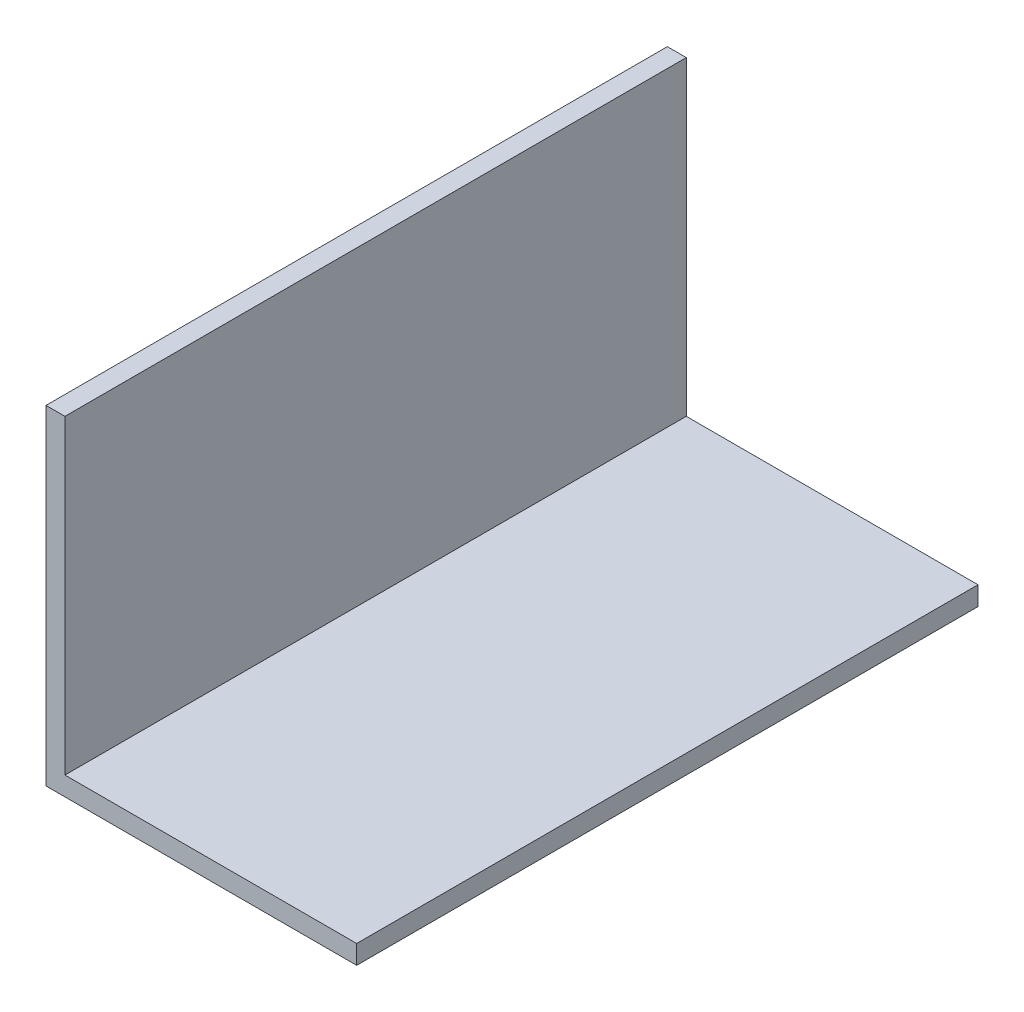
ISO-10303-21;
HEADER;
FILE_DESCRIPTION(('STEP AP214'),'2;1');
FILE_NAME('part.step','',(''),(''),'','','');
FILE_SCHEMA(('AUTOMOTIVE_DESIGN { 1 0 10303 214 1 1 1 1 }'));
ENDSEC;
DATA;
#1=APPLICATION_CONTEXT('core data for automotive mechanical design processes');
#2=APPLICATION_PROTOCOL_DEFINITION('international standard','automotive_design',2000,#1);
#3=PRODUCT_CONTEXT('',#1,'mechanical');
#4=PRODUCT('Part','Part','',(#3));
#5=PRODUCT_RELATED_PRODUCT_CATEGORY('part','',(#4));
#6=PRODUCT_DEFINITION_FORMATION('','',#4);
#7=PRODUCT_DEFINITION_CONTEXT('part definition',#1,'design');
#8=PRODUCT_DEFINITION('design','',#6,#7);
#9=PRODUCT_DEFINITION_SHAPE('','',#8);
#10=(LENGTH_UNIT() NAMED_UNIT(*) SI_UNIT(.MILLI.,.METRE.));
#11=(NAMED_UNIT(*) PLANE_ANGLE_UNIT() SI_UNIT($,.RADIAN.));
#12=(NAMED_UNIT(*) SI_UNIT($,.STERADIAN.) SOLID_ANGLE_UNIT());
#13=UNCERTAINTY_MEASURE_WITH_UNIT(LENGTH_MEASURE(1.E-05),#10,'distance_accuracy_value','');
#14=(GEOMETRIC_REPRESENTATION_CONTEXT(3) GLOBAL_UNCERTAINTY_ASSIGNED_CONTEXT((#13)) GLOBAL_UNIT_ASSIGNED_CONTEXT((#10,
#11,#12)) REPRESENTATION_CONTEXT('',''));
#15=CARTESIAN_POINT('',(0.,0.,0.));
#16=DIRECTION('',(0.,0.,1.));
#17=DIRECTION('',(1.,0.,0.));
#18=AXIS2_PLACEMENT_3D('',#15,#16,#17);
#19=CARTESIAN_POINT('',(4999.99999998,0.,-4999.99));
#20=DIRECTION('',(0.,-1.,0.));
#21=DIRECTION('',(1.,0.,0.));
#22=AXIS2_PLACEMENT_3D('',#19,#20,#21);
#23=PLANE('',#22);
#24=DIRECTION('',(0.,0.,1.));
#25=VECTOR('',#24,1.);
#26=CARTESIAN_POINT('',(4999.99999998,0.,-4999.99));
#27=LINE('',#26,#25);
#28=CARTESIAN_POINT('',(4999.99999998,0.,-4999.99));
#29=VERTEX_POINT('',#28);
#30=CARTESIAN_POINT('',(4999.99999998,0.,4999.99999998));
#31=VERTEX_POINT('',#30);
#32=EDGE_CURVE('E41',#29,#31,#27,.T.);
#33=ORIENTED_EDGE('',*,*,#32,.T.);
#34=DIRECTION('',(1.,0.,0.));
#35=VECTOR('',#34,1.);
#36=CARTESIAN_POINT('',(4999.99999998,0.,4999.99999998));
#37=LINE('',#36,#35);
#38=CARTESIAN_POINT('',(0.,0.,4999.99999998));
#39=VERTEX_POINT('',#38);
#40=EDGE_CURVE('E90',#39,#31,#37,.T.);
#41=ORIENTED_EDGE('',*,*,#40,.F.);
#42=DIRECTION('',(0.,0.,1.));
#43=VECTOR('',#42,1.);
#44=CARTESIAN_POINT('',(0.,0.,-4999.99));
#45=LINE('',#44,#43);
#46=CARTESIAN_POINT('',(0.,0.,-4999.99));
#47=VERTEX_POINT('',#46);
#48=EDGE_CURVE('E11',#47,#39,#45,.T.);
#49=ORIENTED_EDGE('',*,*,#48,.F.);
#50=DIRECTION('',(1.,0.,0.));
#51=VECTOR('',#50,1.);
#52=CARTESIAN_POINT('',(4999.99999998,0.,-4999.99));
#53=LINE('',#52,#51);
#54=EDGE_CURVE('E91',#47,#29,#53,.T.);
#55=ORIENTED_EDGE('',*,*,#54,.T.);
#56=EDGE_LOOP('',(#33,#41,#49,#55));
#57=FACE_BOUND('',#56,.T.);
#58=ADVANCED_FACE('F38',(#57),#23,.T.);
#59=CARTESIAN_POINT('',(0.,0.,-4999.99));
#60=DIRECTION('',(-1.,0.,0.));
#61=DIRECTION('',(0.,0.,1.));
#62=AXIS2_PLACEMENT_3D('',#59,#60,#61);
#63=PLANE('',#62);
#64=ORIENTED_EDGE('',*,*,#48,.T.);
#65=DIRECTION('',(0.,-1.,0.));
#66=VECTOR('',#65,1.);
#67=CARTESIAN_POINT('',(0.,0.,4999.99999998));
#68=LINE('',#67,#66);
#69=CARTESIAN_POINT('',(0.,5304.79999998,4999.99999998));
#70=VERTEX_POINT('',#69);
#71=EDGE_CURVE('E108',#70,#39,#68,.T.);
#72=ORIENTED_EDGE('',*,*,#71,.F.);
#73=DIRECTION('',(0.,0.,1.));
#74=VECTOR('',#73,1.);
#75=CARTESIAN_POINT('',(0.,5304.79999998,-4999.99));
#76=LINE('',#75,#74);
#77=CARTESIAN_POINT('',(0.,5304.79999998,-4999.99));
#78=VERTEX_POINT('',#77);
#79=EDGE_CURVE('E46',#78,#70,#76,.T.);
#80=ORIENTED_EDGE('',*,*,#79,.F.);
#81=DIRECTION('',(0.,-1.,0.));
#82=VECTOR('',#81,1.);
#83=CARTESIAN_POINT('',(0.,0.,-4999.99));
#84=LINE('',#83,#82);
#85=EDGE_CURVE('E96',#78,#47,#84,.T.);
#86=ORIENTED_EDGE('',*,*,#85,.T.);
#87=EDGE_LOOP('',(#64,#72,#80,#86));
#88=FACE_BOUND('',#87,.T.);
#89=ADVANCED_FACE('F148',(#88),#63,.T.);
#90=CARTESIAN_POINT('',(0.,5304.79999998,-4999.99));
#91=DIRECTION('',(0.,1.,0.));
#92=DIRECTION('',(0.,0.,1.));
#93=AXIS2_PLACEMENT_3D('',#90,#91,#92);
#94=PLANE('',#93);
#95=ORIENTED_EDGE('',*,*,#79,.T.);
#96=DIRECTION('',(-1.,0.,0.));
#97=VECTOR('',#96,1.);
#98=CARTESIAN_POINT('',(0.,5304.79999998,4999.99999998));
#99=LINE('',#98,#97);
#100=CARTESIAN_POINT('',(304.8,5304.79999998,4999.99999998));
#101=VERTEX_POINT('',#100);
#102=EDGE_CURVE('E115',#101,#70,#99,.T.);
#103=ORIENTED_EDGE('',*,*,#102,.F.);
#104=DIRECTION('',(0.,0.,1.));
#105=VECTOR('',#104,1.);
#106=CARTESIAN_POINT('',(304.8,5304.79999998,-4999.99));
#107=LINE('',#106,#105);
#108=CARTESIAN_POINT('',(304.8,5304.79999998,-4999.99));
#109=VERTEX_POINT('',#108);
#110=EDGE_CURVE('E131',#109,#101,#107,.T.);
#111=ORIENTED_EDGE('',*,*,#110,.F.);
#112=DIRECTION('',(-1.,0.,0.));
#113=VECTOR('',#112,1.);
#114=CARTESIAN_POINT('',(0.,5304.79999998,-4999.99));
#115=LINE('',#114,#113);
#116=EDGE_CURVE('E127',#109,#78,#115,.T.);
#117=ORIENTED_EDGE('',*,*,#116,.T.);
#118=EDGE_LOOP('',(#95,#103,#111,#117));
#119=FACE_BOUND('',#118,.T.);
#120=ADVANCED_FACE('F144',(#119),#94,.T.);
#121=CARTESIAN_POINT('',(304.8,5304.79999998,-4999.99));
#122=DIRECTION('',(1.,0.,0.));
#123=DIRECTION('',(0.,1.,0.));
#124=AXIS2_PLACEMENT_3D('',#121,#122,#123);
#125=PLANE('',#124);
#126=ORIENTED_EDGE('',*,*,#110,.T.);
#127=DIRECTION('',(0.,1.,0.));
#128=VECTOR('',#127,1.);
#129=CARTESIAN_POINT('',(304.8,5304.79999998,4999.99999998));
#130=LINE('',#129,#128);
#131=CARTESIAN_POINT('',(304.800000000001,304.8,4999.99999998));
#132=VERTEX_POINT('',#131);
#133=EDGE_CURVE('E112',#132,#101,#130,.T.);
#134=ORIENTED_EDGE('',*,*,#133,.F.);
#135=DIRECTION('',(0.,0.,1.));
#136=VECTOR('',#135,1.);
#137=CARTESIAN_POINT('',(304.800000000001,304.8,-4999.99));
#138=LINE('',#137,#136);
#139=CARTESIAN_POINT('',(304.800000000001,304.8,-4999.99));
#140=VERTEX_POINT('',#139);
#141=EDGE_CURVE('E133',#140,#132,#138,.T.);
#142=ORIENTED_EDGE('',*,*,#141,.F.);
#143=DIRECTION('',(0.,1.,0.));
#144=VECTOR('',#143,1.);
#145=CARTESIAN_POINT('',(304.8,5304.79999998,-4999.99));
#146=LINE('',#145,#144);
#147=EDGE_CURVE('E124',#140,#109,#146,.T.);
#148=ORIENTED_EDGE('',*,*,#147,.T.);
#149=EDGE_LOOP('',(#126,#134,#142,#148));
#150=FACE_BOUND('',#149,.T.);
#151=ADVANCED_FACE('F141',(#150),#125,.T.);
#152=CARTESIAN_POINT('',(304.800000000001,304.8,-4999.99));
#153=DIRECTION('',(0.,1.,0.));
#154=DIRECTION('',(-1.,0.,0.));
#155=AXIS2_PLACEMENT_3D('',#152,#153,#154);
#156=PLANE('',#155);
#157=ORIENTED_EDGE('',*,*,#141,.T.);
#158=DIRECTION('',(-1.,0.,0.));
#159=VECTOR('',#158,1.);
#160=CARTESIAN_POINT('',(304.800000000001,304.8,4999.99999998));
#161=LINE('',#160,#159);
#162=CARTESIAN_POINT('',(4999.99999998,304.8,4999.99999998));
#163=VERTEX_POINT('',#162);
#164=EDGE_CURVE('E103',#163,#132,#161,.T.);
#165=ORIENTED_EDGE('',*,*,#164,.F.);
#166=DIRECTION('',(0.,0.,1.));
#167=VECTOR('',#166,1.);
#168=CARTESIAN_POINT('',(4999.99999998,304.8,-4999.99));
#169=LINE('',#168,#167);
#170=CARTESIAN_POINT('',(4999.99999998,304.8,-4999.99));
#171=VERTEX_POINT('',#170);
#172=EDGE_CURVE('E95',#171,#163,#169,.T.);
#173=ORIENTED_EDGE('',*,*,#172,.F.);
#174=DIRECTION('',(-1.,0.,0.));
#175=VECTOR('',#174,1.);
#176=CARTESIAN_POINT('',(304.800000000001,304.8,-4999.99));
#177=LINE('',#176,#175);
#178=EDGE_CURVE('E121',#171,#140,#177,.T.);
#179=ORIENTED_EDGE('',*,*,#178,.T.);
#180=EDGE_LOOP('',(#157,#165,#173,#179));
#181=FACE_BOUND('',#180,.T.);
#182=ADVANCED_FACE('F135',(#181),#156,.T.);
#183=CARTESIAN_POINT('',(4999.99999998,304.8,-4999.99));
#184=DIRECTION('',(1.,0.,0.));
#185=DIRECTION('',(0.,0.,-1.));
#186=AXIS2_PLACEMENT_3D('',#183,#184,#185);
#187=PLANE('',#186);
#188=ORIENTED_EDGE('',*,*,#172,.T.);
#189=DIRECTION('',(0.,1.,0.));
#190=VECTOR('',#189,1.);
#191=CARTESIAN_POINT('',(4999.99999998,304.8,4999.99999998));
#192=LINE('',#191,#190);
#193=EDGE_CURVE('E98',#31,#163,#192,.T.);
#194=ORIENTED_EDGE('',*,*,#193,.F.);
#195=ORIENTED_EDGE('',*,*,#32,.F.);
#196=DIRECTION('',(0.,1.,0.));
#197=VECTOR('',#196,1.);
#198=CARTESIAN_POINT('',(4999.99999998,304.8,-4999.99));
#199=LINE('',#198,#197);
#200=EDGE_CURVE('E119',#29,#171,#199,.T.);
#201=ORIENTED_EDGE('',*,*,#200,.T.);
#202=EDGE_LOOP('',(#188,#194,#195,#201));
#203=FACE_BOUND('',#202,.T.);
#204=ADVANCED_FACE('F99',(#203),#187,.T.);
#205=CARTESIAN_POINT('',(0.,0.,-4999.99));
#206=DIRECTION('',(0.,0.,-1.));
#207=DIRECTION('',(-1.,0.,0.));
#208=AXIS2_PLACEMENT_3D('',#205,#206,#207);
#209=PLANE('',#208);
#210=ORIENTED_EDGE('',*,*,#54,.F.);
#211=ORIENTED_EDGE('',*,*,#85,.F.);
#212=ORIENTED_EDGE('',*,*,#116,.F.);
#213=ORIENTED_EDGE('',*,*,#147,.F.);
#214=ORIENTED_EDGE('',*,*,#178,.F.);
#215=ORIENTED_EDGE('',*,*,#200,.F.);
#216=EDGE_LOOP('',(#210,#211,#212,#213,#214,#215));
#217=FACE_BOUND('',#216,.T.);
#218=ADVANCED_FACE('F147',(#217),#209,.T.);
#219=CARTESIAN_POINT('',(0.,0.,4999.99999998));
#220=DIRECTION('',(0.,0.,-1.));
#221=DIRECTION('',(-1.,0.,0.));
#222=AXIS2_PLACEMENT_3D('',#219,#220,#221);
#223=PLANE('',#222);
#224=ORIENTED_EDGE('',*,*,#40,.T.);
#225=ORIENTED_EDGE('',*,*,#193,.T.);
#226=ORIENTED_EDGE('',*,*,#164,.T.);
#227=ORIENTED_EDGE('',*,*,#133,.T.);
#228=ORIENTED_EDGE('',*,*,#102,.T.);
#229=ORIENTED_EDGE('',*,*,#71,.T.);
#230=EDGE_LOOP('',(#224,#225,#226,#227,#228,#229));
#231=FACE_BOUND('',#230,.T.);
#232=ADVANCED_FACE('F106',(#231),#223,.F.);
#233=CLOSED_SHELL('',(#58,#89,#120,#151,#182,#204,#218,#232));
#234=MANIFOLD_SOLID_BREP('B2',#233);
#235=ADVANCED_BREP_SHAPE_REPRESENTATION('',(#18,#234),#14);
#236=SHAPE_DEFINITION_REPRESENTATION(#9,#235);
ENDSEC;
END-ISO-10303-21;
